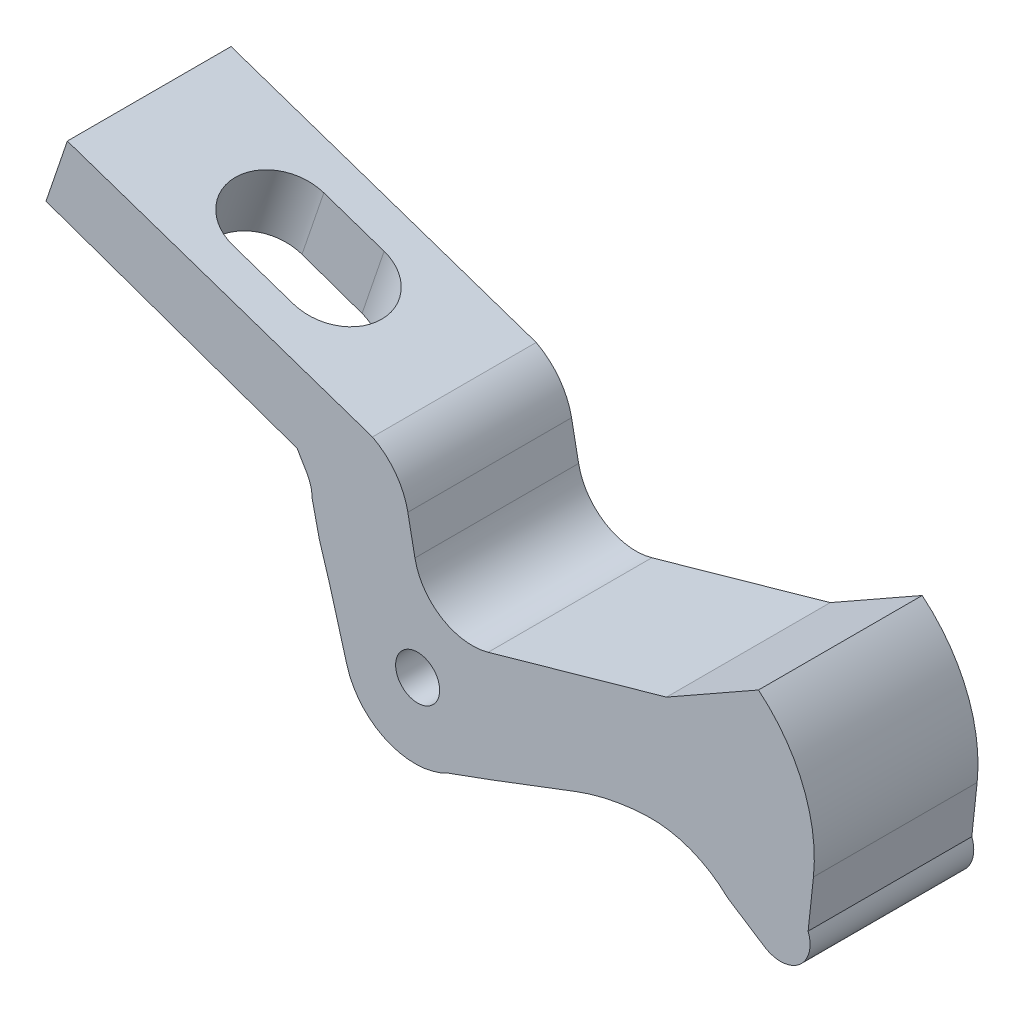
ISO-10303-21;
HEADER;
FILE_DESCRIPTION(('STEP AP214'),'2;1');
FILE_NAME('part.step','',(''),(''),'','','');
FILE_SCHEMA(('AUTOMOTIVE_DESIGN { 1 0 10303 214 1 1 1 1 }'));
ENDSEC;
DATA;
#1=APPLICATION_CONTEXT('core data for automotive mechanical design processes');
#2=APPLICATION_PROTOCOL_DEFINITION('international standard','automotive_design',2000,#1);
#3=PRODUCT_CONTEXT('',#1,'mechanical');
#4=PRODUCT('Part','Part','',(#3));
#5=PRODUCT_RELATED_PRODUCT_CATEGORY('part','',(#4));
#6=PRODUCT_DEFINITION_FORMATION('','',#4);
#7=PRODUCT_DEFINITION_CONTEXT('part definition',#1,'design');
#8=PRODUCT_DEFINITION('design','',#6,#7);
#9=PRODUCT_DEFINITION_SHAPE('','',#8);
#10=(LENGTH_UNIT() NAMED_UNIT(*) SI_UNIT(.MILLI.,.METRE.));
#11=(NAMED_UNIT(*) PLANE_ANGLE_UNIT() SI_UNIT($,.RADIAN.));
#12=(NAMED_UNIT(*) SI_UNIT($,.STERADIAN.) SOLID_ANGLE_UNIT());
#13=UNCERTAINTY_MEASURE_WITH_UNIT(LENGTH_MEASURE(1.E-05),#10,'distance_accuracy_value','');
#14=(GEOMETRIC_REPRESENTATION_CONTEXT(3) GLOBAL_UNCERTAINTY_ASSIGNED_CONTEXT((#13)) GLOBAL_UNIT_ASSIGNED_CONTEXT((#10,
#11,#12)) REPRESENTATION_CONTEXT('',''));
#15=CARTESIAN_POINT('',(0.,0.,0.));
#16=DIRECTION('',(0.,0.,1.));
#17=DIRECTION('',(1.,0.,0.));
#18=AXIS2_PLACEMENT_3D('',#15,#16,#17);
#19=CARTESIAN_POINT('',(45.5253919448835,21.3094985724797,18.));
#20=DIRECTION('',(0.,0.,1.));
#21=DIRECTION('',(1.,0.,0.));
#22=AXIS2_PLACEMENT_3D('',#19,#20,#21);
#23=PLANE('',#22);
#24=DIRECTION('',(0.219332222794712,-0.975650232431649,0.));
#25=VECTOR('',#24,1.);
#26=CARTESIAN_POINT('',(34.2322664001663,33.1216852431344,18.));
#27=LINE('',#26,#25);
#28=CARTESIAN_POINT('',(34.2322664001663,33.1216852431344,18.));
#29=VERTEX_POINT('',#28);
#30=CARTESIAN_POINT('',(35.0165157222853,29.6331279137085,18.));
#31=VERTEX_POINT('',#30);
#32=EDGE_CURVE('E327',#29,#31,#27,.T.);
#33=ORIENTED_EDGE('',*,*,#32,.T.);
#34=DIRECTION('',(0.294085848837523,-0.95577900872195,0.));
#35=VECTOR('',#34,1.);
#36=CARTESIAN_POINT('',(35.0165157222853,29.6331279137085,18.));
#37=LINE('',#36,#35);
#38=CARTESIAN_POINT('',(36.098238925208,26.1175275042095,18.));
#39=VERTEX_POINT('',#38);
#40=EDGE_CURVE('E330',#31,#39,#37,.T.);
#41=ORIENTED_EDGE('',*,*,#40,.T.);
#42=DIRECTION('',(0.271620892976652,-0.962404327971651,0.));
#43=VECTOR('',#42,1.);
#44=CARTESIAN_POINT('',(36.098238925208,26.1175275042095,18.));
#45=LINE('',#44,#43);
#46=CARTESIAN_POINT('',(38.0506171937993,19.1998810929243,18.));
#47=VERTEX_POINT('',#46);
#48=EDGE_CURVE('E333',#39,#47,#45,.T.);
#49=ORIENTED_EDGE('',*,*,#48,.T.);
#50=CARTESIAN_POINT('',(45.5253919448835,21.3094985724797,18.));
#51=DIRECTION('',(0.,0.,1.));
#52=DIRECTION('',(1.,0.,0.));
#53=AXIS2_PLACEMENT_3D('',#50,#51,#52);
#54=CIRCLE('',#53,7.76677175469267);
#55=CARTESIAN_POINT('',(49.1996547815683,14.4667990981167,18.));
#56=VERTEX_POINT('',#55);
#57=EDGE_CURVE('E335',#47,#56,#54,.T.);
#58=ORIENTED_EDGE('',*,*,#57,.T.);
#59=DIRECTION('',(0.939316602290552,0.34305148398066,0.));
#60=VECTOR('',#59,1.);
#61=CARTESIAN_POINT('',(49.1996547815683,14.4667990981167,18.));
#62=LINE('',#61,#60);
#63=CARTESIAN_POINT('',(53.8800761085958,16.1761540461461,18.));
#64=VERTEX_POINT('',#63);
#65=EDGE_CURVE('E337',#56,#64,#62,.T.);
#66=ORIENTED_EDGE('',*,*,#65,.T.);
#67=DIRECTION('',(0.934755486982712,0.35529168236213,0.));
#68=VECTOR('',#67,1.);
#69=CARTESIAN_POINT('',(53.8800761085958,16.1761540461461,18.));
#70=LINE('',#69,#68);
#71=CARTESIAN_POINT('',(63.1672079885199,19.7061046651984,18.));
#72=VERTEX_POINT('',#71);
#73=EDGE_CURVE('E339',#64,#72,#70,.T.);
#74=ORIENTED_EDGE('',*,*,#73,.T.);
#75=CARTESIAN_POINT('',(72.0012758517927,-3.53590694810821,18.));
#76=DIRECTION('',(0.,0.,-1.));
#77=DIRECTION('',(-1.,0.,0.));
#78=AXIS2_PLACEMENT_3D('',#75,#76,#77);
#79=CIRCLE('',#78,24.8642687172977);
#80=CARTESIAN_POINT('',(71.0329353313522,21.3094985724797,18.));
#81=VERTEX_POINT('',#80);
#82=EDGE_CURVE('E341',#72,#81,#79,.T.);
#83=ORIENTED_EDGE('',*,*,#82,.T.);
#84=CARTESIAN_POINT('',(71.506979557392,9.14660671570463,18.));
#85=DIRECTION('',(0.,0.,-1.));
#86=DIRECTION('',(-1.,0.,0.));
#87=AXIS2_PLACEMENT_3D('',#84,#85,#86);
#88=CIRCLE('',#87,12.1721262007855);
#89=CARTESIAN_POINT('',(79.9222649229007,17.9411293556722,18.));
#90=VERTEX_POINT('',#89);
#91=EDGE_CURVE('E343',#81,#90,#88,.T.);
#92=ORIENTED_EDGE('',*,*,#91,.T.);
#93=DIRECTION('',(0.839379612484412,-0.543545643111523,0.));
#94=VECTOR('',#93,1.);
#95=CARTESIAN_POINT('',(79.9222649229007,17.9411293556723,18.));
#96=LINE('',#95,#94);
#97=CARTESIAN_POINT('',(83.9677083298329,15.3214765721314,18.));
#98=VERTEX_POINT('',#97);
#99=EDGE_CURVE('E345',#90,#98,#96,.T.);
#100=ORIENTED_EDGE('',*,*,#99,.T.);
#101=CARTESIAN_POINT('',(85.7298879733201,18.0427524852468,18.));
#102=DIRECTION('',(0.,0.,1.));
#103=DIRECTION('',(1.,0.,0.));
#104=AXIS2_PLACEMENT_3D('',#101,#102,#103);
#105=CIRCLE('',#104,3.2420085890113);
#106=CARTESIAN_POINT('',(88.7583649959369,19.1998810929243,18.));
#107=VERTEX_POINT('',#106);
#108=EDGE_CURVE('E347',#98,#107,#105,.T.);
#109=ORIENTED_EDGE('',*,*,#108,.T.);
#110=DIRECTION('',(0.106791532196492,0.994281433323144,0.));
#111=VECTOR('',#110,1.);
#112=CARTESIAN_POINT('',(88.7583649959369,19.1998810929243,18.));
#113=LINE('',#112,#111);
#114=CARTESIAN_POINT('',(89.3438896995718,24.651402665862,18.));
#115=VERTEX_POINT('',#114);
#116=EDGE_CURVE('E349',#107,#115,#113,.T.);
#117=ORIENTED_EDGE('',*,*,#116,.T.);
#118=CARTESIAN_POINT('',(72.6215158410173,26.44748158926,18.));
#119=DIRECTION('',(0.,0.,1.));
#120=DIRECTION('',(1.,0.,0.));
#121=AXIS2_PLACEMENT_3D('',#118,#119,#120);
#122=CIRCLE('',#121,16.8185518688245);
#123=CARTESIAN_POINT('',(83.3015644321972,39.4397965890734,18.));
#124=VERTEX_POINT('',#123);
#125=EDGE_CURVE('E351',#115,#124,#122,.T.);
#126=ORIENTED_EDGE('',*,*,#125,.T.);
#127=DIRECTION('',(-0.869852027315479,-0.493312731008587,0.));
#128=VECTOR('',#127,1.);
#129=CARTESIAN_POINT('',(83.3015644321972,39.4397965890734,18.));
#130=LINE('',#129,#128);
#131=CARTESIAN_POINT('',(73.1896493904358,33.7051011830364,18.));
#132=VERTEX_POINT('',#131);
#133=EDGE_CURVE('E353',#124,#132,#130,.T.);
#134=ORIENTED_EDGE('',*,*,#133,.T.);
#135=DIRECTION('',(-0.962404327971652,-0.271620892976652,0.));
#136=VECTOR('',#135,1.);
#137=CARTESIAN_POINT('',(73.1896493904358,33.7051011830364,18.));
#138=LINE('',#137,#136);
#139=CARTESIAN_POINT('',(53.578886424286,28.1703245886236,18.));
#140=VERTEX_POINT('',#139);
#141=EDGE_CURVE('E355',#132,#140,#138,.T.);
#142=ORIENTED_EDGE('',*,*,#141,.T.);
#143=CARTESIAN_POINT('',(51.8330884395511,34.3560178829073,18.));
#144=DIRECTION('',(0.,0.,-1.));
#145=DIRECTION('',(-1.,0.,0.));
#146=AXIS2_PLACEMENT_3D('',#143,#144,#145);
#147=CIRCLE('',#146,6.42733320549438);
#148=CARTESIAN_POINT('',(45.5253919448835,33.1216852431344,18.));
#149=VERTEX_POINT('',#148);
#150=EDGE_CURVE('E357',#140,#149,#147,.T.);
#151=ORIENTED_EDGE('',*,*,#150,.T.);
#152=DIRECTION('',(-0.19204428964687,0.981386259743853,0.));
#153=VECTOR('',#152,1.);
#154=CARTESIAN_POINT('',(45.5253919448835,33.1216852431344,18.));
#155=LINE('',#154,#153);
#156=CARTESIAN_POINT('',(44.7492996050408,37.0876785044525,18.));
#157=VERTEX_POINT('',#156);
#158=EDGE_CURVE('E359',#149,#157,#155,.T.);
#159=ORIENTED_EDGE('',*,*,#158,.T.);
#160=CARTESIAN_POINT('',(37.3562633686608,35.6409592557851,18.));
#161=DIRECTION('',(0.,0.,1.));
#162=DIRECTION('',(1.,0.,0.));
#163=AXIS2_PLACEMENT_3D('',#160,#161,#162);
#164=CIRCLE('',#163,7.5332583506005);
#165=CARTESIAN_POINT('',(40.8576012745902,42.3110877586997,18.));
#166=VERTEX_POINT('',#165);
#167=EDGE_CURVE('E361',#157,#166,#164,.T.);
#168=ORIENTED_EDGE('',*,*,#167,.T.);
#169=DIRECTION('',(0.94679952157974,-0.321823967311907,0.));
#170=VECTOR('',#169,1.);
#171=CARTESIAN_POINT('',(7.30944569515984,53.7143471377868,18.));
#172=LINE('',#171,#170);
#173=CARTESIAN_POINT('',(7.30944569515984,53.7143471377868,18.));
#174=VERTEX_POINT('',#173);
#175=EDGE_CURVE('E363',#174,#166,#172,.T.);
#176=ORIENTED_EDGE('',*,*,#175,.F.);
#177=DIRECTION('',(-0.321823967311907,-0.94679952157974,0.));
#178=VECTOR('',#177,1.);
#179=CARTESIAN_POINT('',(7.30944569515984,53.7143471377868,18.));
#180=LINE('',#179,#178);
#181=CARTESIAN_POINT('',(4.96334493977308,46.8121667584579,18.));
#182=VERTEX_POINT('',#181);
#183=EDGE_CURVE('E366',#174,#182,#180,.T.);
#184=ORIENTED_EDGE('',*,*,#183,.T.);
#185=DIRECTION('',(0.943199177295915,-0.332227801287473,0.));
#186=VECTOR('',#185,1.);
#187=CARTESIAN_POINT('',(4.96334493977308,46.8121667584579,18.));
#188=LINE('',#187,#186);
#189=CARTESIAN_POINT('',(32.5712973304433,37.0876785044525,18.));
#190=VERTEX_POINT('',#189);
#191=EDGE_CURVE('E368',#182,#190,#188,.T.);
#192=ORIENTED_EDGE('',*,*,#191,.T.);
#193=DIRECTION('',(0.510840332146581,-0.859675610362636,0.));
#194=VECTOR('',#193,1.);
#195=CARTESIAN_POINT('',(32.5712973304433,37.0876785044525,18.));
#196=LINE('',#195,#194);
#197=CARTESIAN_POINT('',(33.6102755584857,35.339217809126,18.));
#198=VERTEX_POINT('',#197);
#199=EDGE_CURVE('E370',#190,#198,#196,.T.);
#200=ORIENTED_EDGE('',*,*,#199,.T.);
#201=CARTESIAN_POINT('',(29.7981725271643,33.0739726919873,18.));
#202=DIRECTION('',(0.,0.,-1.));
#203=DIRECTION('',(-1.,0.,0.));
#204=AXIS2_PLACEMENT_3D('',#201,#202,#203);
#205=CIRCLE('',#204,4.43435056824905);
#206=EDGE_CURVE('E372',#198,#29,#205,.T.);
#207=ORIENTED_EDGE('',*,*,#206,.T.);
#208=EDGE_LOOP('',(#33,#41,#49,#58,#66,#74,#83,#92,#100,#109,#117,#126,#134,#142,#151,#159,#168,
#176,#184,#192,#200,#207));
#209=FACE_BOUND('',#208,.T.);
#210=CARTESIAN_POINT('',(45.8228161935071,21.8786184753552,18.));
#211=DIRECTION('',(0.,0.,1.));
#212=DIRECTION('',(1.,0.,0.));
#213=AXIS2_PLACEMENT_3D('',#210,#211,#212);
#214=CIRCLE('',#213,2.42054008083515);
#215=CARTESIAN_POINT('',(48.2433562743423,21.8786184753552,18.));
#216=VERTEX_POINT('',#215);
#217=EDGE_CURVE('E321',#216,#216,#214,.T.);
#218=ORIENTED_EDGE('',*,*,#217,.F.);
#219=EDGE_LOOP('',(#218));
#220=FACE_BOUND('',#219,.T.);
#221=ADVANCED_FACE('F119',(#209,#220),#23,.T.);
#222=CARTESIAN_POINT('',(45.5253919448835,21.3094985724797,0.));
#223=DIRECTION('',(0.,0.,1.));
#224=DIRECTION('',(1.,0.,0.));
#225=AXIS2_PLACEMENT_3D('',#222,#223,#224);
#226=PLANE('',#225);
#227=DIRECTION('',(0.219332222794712,-0.975650232431649,0.));
#228=VECTOR('',#227,1.);
#229=CARTESIAN_POINT('',(34.2322664001663,33.1216852431344,0.));
#230=LINE('',#229,#228);
#231=CARTESIAN_POINT('',(34.2322664001663,33.1216852431344,0.));
#232=VERTEX_POINT('',#231);
#233=CARTESIAN_POINT('',(35.0165157222853,29.6331279137085,0.));
#234=VERTEX_POINT('',#233);
#235=EDGE_CURVE('E324',#232,#234,#230,.T.);
#236=ORIENTED_EDGE('',*,*,#235,.F.);
#237=CARTESIAN_POINT('',(29.7981725271643,33.0739726919873,0.));
#238=DIRECTION('',(0.,0.,-1.));
#239=DIRECTION('',(-1.,0.,0.));
#240=AXIS2_PLACEMENT_3D('',#237,#238,#239);
#241=CIRCLE('',#240,4.43435056824905);
#242=CARTESIAN_POINT('',(33.6102755584857,35.339217809126,0.));
#243=VERTEX_POINT('',#242);
#244=EDGE_CURVE('E331',#243,#232,#241,.T.);
#245=ORIENTED_EDGE('',*,*,#244,.F.);
#246=DIRECTION('',(0.510840332146581,-0.859675610362636,0.));
#247=VECTOR('',#246,1.);
#248=CARTESIAN_POINT('',(32.5712973304433,37.0876785044525,0.));
#249=LINE('',#248,#247);
#250=CARTESIAN_POINT('',(32.5712973304433,37.0876785044525,0.));
#251=VERTEX_POINT('',#250);
#252=EDGE_CURVE('E419',#251,#243,#249,.T.);
#253=ORIENTED_EDGE('',*,*,#252,.F.);
#254=DIRECTION('',(0.943199177295915,-0.332227801287473,0.));
#255=VECTOR('',#254,1.);
#256=CARTESIAN_POINT('',(4.96334493977308,46.8121667584579,0.));
#257=LINE('',#256,#255);
#258=CARTESIAN_POINT('',(4.96334493977308,46.8121667584579,0.));
#259=VERTEX_POINT('',#258);
#260=EDGE_CURVE('E417',#259,#251,#257,.T.);
#261=ORIENTED_EDGE('',*,*,#260,.F.);
#262=DIRECTION('',(-0.321823967311907,-0.94679952157974,0.));
#263=VECTOR('',#262,1.);
#264=CARTESIAN_POINT('',(7.30944569515984,53.7143471377868,0.));
#265=LINE('',#264,#263);
#266=CARTESIAN_POINT('',(7.30944569515984,53.7143471377868,0.));
#267=VERTEX_POINT('',#266);
#268=EDGE_CURVE('E415',#267,#259,#265,.T.);
#269=ORIENTED_EDGE('',*,*,#268,.F.);
#270=DIRECTION('',(0.94679952157974,-0.321823967311907,0.));
#271=VECTOR('',#270,1.);
#272=CARTESIAN_POINT('',(7.30944569515984,53.7143471377868,0.));
#273=LINE('',#272,#271);
#274=CARTESIAN_POINT('',(40.8576012745902,42.3110877586997,0.));
#275=VERTEX_POINT('',#274);
#276=EDGE_CURVE('E412',#267,#275,#273,.T.);
#277=ORIENTED_EDGE('',*,*,#276,.T.);
#278=CARTESIAN_POINT('',(37.3562633686608,35.6409592557851,0.));
#279=DIRECTION('',(0.,0.,1.));
#280=DIRECTION('',(1.,0.,0.));
#281=AXIS2_PLACEMENT_3D('',#278,#279,#280);
#282=CIRCLE('',#281,7.5332583506005);
#283=CARTESIAN_POINT('',(44.7492996050408,37.0876785044525,0.));
#284=VERTEX_POINT('',#283);
#285=EDGE_CURVE('E409',#284,#275,#282,.T.);
#286=ORIENTED_EDGE('',*,*,#285,.F.);
#287=DIRECTION('',(-0.19204428964687,0.981386259743853,0.));
#288=VECTOR('',#287,1.);
#289=CARTESIAN_POINT('',(45.5253919448835,33.1216852431344,0.));
#290=LINE('',#289,#288);
#291=CARTESIAN_POINT('',(45.5253919448835,33.1216852431344,0.));
#292=VERTEX_POINT('',#291);
#293=EDGE_CURVE('E407',#292,#284,#290,.T.);
#294=ORIENTED_EDGE('',*,*,#293,.F.);
#295=CARTESIAN_POINT('',(51.8330884395511,34.3560178829073,0.));
#296=DIRECTION('',(0.,0.,-1.));
#297=DIRECTION('',(-1.,0.,0.));
#298=AXIS2_PLACEMENT_3D('',#295,#296,#297);
#299=CIRCLE('',#298,6.42733320549438);
#300=CARTESIAN_POINT('',(53.578886424286,28.1703245886236,0.));
#301=VERTEX_POINT('',#300);
#302=EDGE_CURVE('E405',#301,#292,#299,.T.);
#303=ORIENTED_EDGE('',*,*,#302,.F.);
#304=DIRECTION('',(-0.962404327971652,-0.271620892976652,0.));
#305=VECTOR('',#304,1.);
#306=CARTESIAN_POINT('',(60.3348577971169,30.0770730558511,0.));
#307=LINE('',#306,#305);
#308=CARTESIAN_POINT('',(73.1896493904358,33.7051011830364,0.));
#309=VERTEX_POINT('',#308);
#310=EDGE_CURVE('E403',#309,#301,#307,.T.);
#311=ORIENTED_EDGE('',*,*,#310,.F.);
#312=DIRECTION('',(-0.86985202731548,-0.493312731008587,0.));
#313=VECTOR('',#312,1.);
#314=CARTESIAN_POINT('',(77.6866251453855,36.255437701536,0.));
#315=LINE('',#314,#313);
#316=CARTESIAN_POINT('',(83.3015644321972,39.4397965890734,0.));
#317=VERTEX_POINT('',#316);
#318=EDGE_CURVE('E400',#317,#309,#315,.T.);
#319=ORIENTED_EDGE('',*,*,#318,.F.);
#320=CARTESIAN_POINT('',(72.6215158410173,26.44748158926,0.));
#321=DIRECTION('',(0.,0.,1.));
#322=DIRECTION('',(1.,0.,0.));
#323=AXIS2_PLACEMENT_3D('',#320,#321,#322);
#324=CIRCLE('',#323,16.8185518688245);
#325=CARTESIAN_POINT('',(89.3438896995718,24.651402665862,0.));
#326=VERTEX_POINT('',#325);
#327=EDGE_CURVE('E397',#326,#317,#324,.T.);
#328=ORIENTED_EDGE('',*,*,#327,.F.);
#329=DIRECTION('',(0.106791532196492,0.994281433323144,0.));
#330=VECTOR('',#329,1.);
#331=CARTESIAN_POINT('',(88.7583649959369,19.1998810929243,0.));
#332=LINE('',#331,#330);
#333=CARTESIAN_POINT('',(88.7583649959369,19.1998810929243,0.));
#334=VERTEX_POINT('',#333);
#335=EDGE_CURVE('E395',#334,#326,#332,.T.);
#336=ORIENTED_EDGE('',*,*,#335,.F.);
#337=CARTESIAN_POINT('',(85.7298879733201,18.0427524852468,0.));
#338=DIRECTION('',(0.,0.,1.));
#339=DIRECTION('',(1.,0.,0.));
#340=AXIS2_PLACEMENT_3D('',#337,#338,#339);
#341=CIRCLE('',#340,3.2420085890113);
#342=CARTESIAN_POINT('',(83.9677083298329,15.3214765721314,0.));
#343=VERTEX_POINT('',#342);
#344=EDGE_CURVE('E393',#343,#334,#341,.T.);
#345=ORIENTED_EDGE('',*,*,#344,.F.);
#346=DIRECTION('',(0.839379612484412,-0.543545643111523,0.));
#347=VECTOR('',#346,1.);
#348=CARTESIAN_POINT('',(79.9222649229007,17.9411293556723,0.));
#349=LINE('',#348,#347);
#350=CARTESIAN_POINT('',(79.9222649229007,17.9411293556722,0.));
#351=VERTEX_POINT('',#350);
#352=EDGE_CURVE('E391',#351,#343,#349,.T.);
#353=ORIENTED_EDGE('',*,*,#352,.F.);
#354=CARTESIAN_POINT('',(71.506979557392,9.14660671570463,0.));
#355=DIRECTION('',(0.,0.,-1.));
#356=DIRECTION('',(-1.,0.,0.));
#357=AXIS2_PLACEMENT_3D('',#354,#355,#356);
#358=CIRCLE('',#357,12.1721262007855);
#359=CARTESIAN_POINT('',(71.0329353313522,21.3094985724797,0.));
#360=VERTEX_POINT('',#359);
#361=EDGE_CURVE('E389',#360,#351,#358,.T.);
#362=ORIENTED_EDGE('',*,*,#361,.F.);
#363=CARTESIAN_POINT('',(72.0012758517927,-3.53590694810821,0.));
#364=DIRECTION('',(0.,0.,-1.));
#365=DIRECTION('',(-1.,0.,0.));
#366=AXIS2_PLACEMENT_3D('',#363,#364,#365);
#367=CIRCLE('',#366,24.8642687172977);
#368=CARTESIAN_POINT('',(63.1672079885199,19.7061046651984,0.));
#369=VERTEX_POINT('',#368);
#370=EDGE_CURVE('E387',#369,#360,#367,.T.);
#371=ORIENTED_EDGE('',*,*,#370,.F.);
#372=DIRECTION('',(0.934755486982712,0.35529168236213,0.));
#373=VECTOR('',#372,1.);
#374=CARTESIAN_POINT('',(53.8800761085958,16.1761540461461,0.));
#375=LINE('',#374,#373);
#376=CARTESIAN_POINT('',(53.8800761085958,16.1761540461461,0.));
#377=VERTEX_POINT('',#376);
#378=EDGE_CURVE('E385',#377,#369,#375,.T.);
#379=ORIENTED_EDGE('',*,*,#378,.F.);
#380=DIRECTION('',(0.939316602290552,0.34305148398066,0.));
#381=VECTOR('',#380,1.);
#382=CARTESIAN_POINT('',(49.1996547815683,14.4667990981167,0.));
#383=LINE('',#382,#381);
#384=CARTESIAN_POINT('',(49.1996547815683,14.4667990981167,0.));
#385=VERTEX_POINT('',#384);
#386=EDGE_CURVE('E383',#385,#377,#383,.T.);
#387=ORIENTED_EDGE('',*,*,#386,.F.);
#388=CARTESIAN_POINT('',(45.5253919448835,21.3094985724797,0.));
#389=DIRECTION('',(0.,0.,1.));
#390=DIRECTION('',(1.,0.,0.));
#391=AXIS2_PLACEMENT_3D('',#388,#389,#390);
#392=CIRCLE('',#391,7.76677175469267);
#393=CARTESIAN_POINT('',(38.0506171937993,19.1998810929243,0.));
#394=VERTEX_POINT('',#393);
#395=EDGE_CURVE('E381',#394,#385,#392,.T.);
#396=ORIENTED_EDGE('',*,*,#395,.F.);
#397=DIRECTION('',(0.271620892976652,-0.962404327971651,0.));
#398=VECTOR('',#397,1.);
#399=CARTESIAN_POINT('',(36.098238925208,26.1175275042095,0.));
#400=LINE('',#399,#398);
#401=CARTESIAN_POINT('',(36.098238925208,26.1175275042095,0.));
#402=VERTEX_POINT('',#401);
#403=EDGE_CURVE('E379',#402,#394,#400,.T.);
#404=ORIENTED_EDGE('',*,*,#403,.F.);
#405=DIRECTION('',(0.294085848837523,-0.95577900872195,0.));
#406=VECTOR('',#405,1.);
#407=CARTESIAN_POINT('',(35.0165157222853,29.6331279137085,0.));
#408=LINE('',#407,#406);
#409=EDGE_CURVE('E377',#234,#402,#408,.T.);
#410=ORIENTED_EDGE('',*,*,#409,.F.);
#411=EDGE_LOOP('',(#236,#245,#253,#261,#269,#277,#286,#294,#303,#311,#319,#328,#336,#345,#353,
#362,#371,#379,#387,#396,#404,#410));
#412=FACE_BOUND('',#411,.T.);
#413=CARTESIAN_POINT('',(45.8228161935071,21.8786184753552,0.));
#414=DIRECTION('',(0.,0.,1.));
#415=DIRECTION('',(1.,0.,0.));
#416=AXIS2_PLACEMENT_3D('',#413,#414,#415);
#417=CIRCLE('',#416,2.42054008083515);
#418=CARTESIAN_POINT('',(48.2433562743423,21.8786184753552,0.));
#419=VERTEX_POINT('',#418);
#420=EDGE_CURVE('E318',#419,#419,#417,.T.);
#421=ORIENTED_EDGE('',*,*,#420,.T.);
#422=EDGE_LOOP('',(#421));
#423=FACE_BOUND('',#422,.T.);
#424=ADVANCED_FACE('F508',(#412,#423),#226,.F.);
#425=CARTESIAN_POINT('',(34.2322664001663,33.1216852431344,18.));
#426=DIRECTION('',(0.975650232431649,0.219332222794712,0.));
#427=DIRECTION('',(-0.219332222794712,0.975650232431649,0.));
#428=AXIS2_PLACEMENT_3D('',#425,#426,#427);
#429=PLANE('',#428);
#430=ORIENTED_EDGE('',*,*,#235,.T.);
#431=DIRECTION('',(0.,0.,-1.));
#432=VECTOR('',#431,1.);
#433=CARTESIAN_POINT('',(35.0165157222853,29.6331279137085,18.));
#434=LINE('',#433,#432);
#435=EDGE_CURVE('E482',#31,#234,#434,.T.);
#436=ORIENTED_EDGE('',*,*,#435,.F.);
#437=ORIENTED_EDGE('',*,*,#32,.F.);
#438=DIRECTION('',(0.,0.,-1.));
#439=VECTOR('',#438,1.);
#440=CARTESIAN_POINT('',(34.2322664001663,33.1216852431344,18.));
#441=LINE('',#440,#439);
#442=EDGE_CURVE('E374',#29,#232,#441,.T.);
#443=ORIENTED_EDGE('',*,*,#442,.T.);
#444=EDGE_LOOP('',(#430,#436,#437,#443));
#445=FACE_BOUND('',#444,.T.);
#446=ADVANCED_FACE('F121',(#445),#429,.F.);
#447=CARTESIAN_POINT('',(35.0165157222853,29.6331279137085,18.));
#448=DIRECTION('',(0.95577900872195,0.294085848837523,0.));
#449=DIRECTION('',(-0.294085848837523,0.95577900872195,0.));
#450=AXIS2_PLACEMENT_3D('',#447,#448,#449);
#451=PLANE('',#450);
#452=ORIENTED_EDGE('',*,*,#409,.T.);
#453=DIRECTION('',(0.,0.,-1.));
#454=VECTOR('',#453,1.);
#455=CARTESIAN_POINT('',(36.098238925208,26.1175275042095,18.));
#456=LINE('',#455,#454);
#457=EDGE_CURVE('E479',#39,#402,#456,.T.);
#458=ORIENTED_EDGE('',*,*,#457,.F.);
#459=ORIENTED_EDGE('',*,*,#40,.F.);
#460=ORIENTED_EDGE('',*,*,#435,.T.);
#461=EDGE_LOOP('',(#452,#458,#459,#460));
#462=FACE_BOUND('',#461,.T.);
#463=ADVANCED_FACE('F591',(#462),#451,.F.);
#464=CARTESIAN_POINT('',(36.098238925208,26.1175275042095,18.));
#465=DIRECTION('',(0.962404327971651,0.271620892976652,0.));
#466=DIRECTION('',(-0.271620892976652,0.962404327971652,0.));
#467=AXIS2_PLACEMENT_3D('',#464,#465,#466);
#468=PLANE('',#467);
#469=ORIENTED_EDGE('',*,*,#403,.T.);
#470=DIRECTION('',(0.,0.,-1.));
#471=VECTOR('',#470,1.);
#472=CARTESIAN_POINT('',(38.0506171937993,19.1998810929243,18.));
#473=LINE('',#472,#471);
#474=EDGE_CURVE('E476',#47,#394,#473,.T.);
#475=ORIENTED_EDGE('',*,*,#474,.F.);
#476=ORIENTED_EDGE('',*,*,#48,.F.);
#477=ORIENTED_EDGE('',*,*,#457,.T.);
#478=EDGE_LOOP('',(#469,#475,#476,#477));
#479=FACE_BOUND('',#478,.T.);
#480=ADVANCED_FACE('F588',(#479),#468,.F.);
#481=CARTESIAN_POINT('',(45.5253919448835,21.3094985724797,18.));
#482=DIRECTION('',(0.,0.,-1.));
#483=DIRECTION('',(-1.,0.,0.));
#484=AXIS2_PLACEMENT_3D('',#481,#482,#483);
#485=CYLINDRICAL_SURFACE('',#484,7.76677175469267);
#486=ORIENTED_EDGE('',*,*,#395,.T.);
#487=DIRECTION('',(0.,0.,-1.));
#488=VECTOR('',#487,1.);
#489=CARTESIAN_POINT('',(49.1996547815683,14.4667990981167,18.));
#490=LINE('',#489,#488);
#491=EDGE_CURVE('E473',#56,#385,#490,.T.);
#492=ORIENTED_EDGE('',*,*,#491,.F.);
#493=ORIENTED_EDGE('',*,*,#57,.F.);
#494=ORIENTED_EDGE('',*,*,#474,.T.);
#495=EDGE_LOOP('',(#486,#492,#493,#494));
#496=FACE_BOUND('',#495,.T.);
#497=ADVANCED_FACE('F584',(#496),#485,.T.);
#498=CARTESIAN_POINT('',(49.1996547815683,14.4667990981167,18.));
#499=DIRECTION('',(-0.343051483980661,0.939316602290552,0.));
#500=DIRECTION('',(-0.939316602290552,-0.343051483980661,0.));
#501=AXIS2_PLACEMENT_3D('',#498,#499,#500);
#502=PLANE('',#501);
#503=ORIENTED_EDGE('',*,*,#386,.T.);
#504=DIRECTION('',(0.,0.,-1.));
#505=VECTOR('',#504,1.);
#506=CARTESIAN_POINT('',(53.8800761085958,16.1761540461461,18.));
#507=LINE('',#506,#505);
#508=EDGE_CURVE('E470',#64,#377,#507,.T.);
#509=ORIENTED_EDGE('',*,*,#508,.F.);
#510=ORIENTED_EDGE('',*,*,#65,.F.);
#511=ORIENTED_EDGE('',*,*,#491,.T.);
#512=EDGE_LOOP('',(#503,#509,#510,#511));
#513=FACE_BOUND('',#512,.T.);
#514=ADVANCED_FACE('F580',(#513),#502,.F.);
#515=CARTESIAN_POINT('',(53.8800761085958,16.1761540461461,18.));
#516=DIRECTION('',(-0.35529168236213,0.934755486982712,0.));
#517=DIRECTION('',(-0.934755486982712,-0.35529168236213,0.));
#518=AXIS2_PLACEMENT_3D('',#515,#516,#517);
#519=PLANE('',#518);
#520=ORIENTED_EDGE('',*,*,#378,.T.);
#521=DIRECTION('',(0.,0.,-1.));
#522=VECTOR('',#521,1.);
#523=CARTESIAN_POINT('',(63.1672079885199,19.7061046651984,18.));
#524=LINE('',#523,#522);
#525=EDGE_CURVE('E467',#72,#369,#524,.T.);
#526=ORIENTED_EDGE('',*,*,#525,.F.);
#527=ORIENTED_EDGE('',*,*,#73,.F.);
#528=ORIENTED_EDGE('',*,*,#508,.T.);
#529=EDGE_LOOP('',(#520,#526,#527,#528));
#530=FACE_BOUND('',#529,.T.);
#531=ADVANCED_FACE('F576',(#530),#519,.F.);
#532=CARTESIAN_POINT('',(72.0012758517927,-3.53590694810821,18.));
#533=DIRECTION('',(0.,0.,-1.));
#534=DIRECTION('',(-1.,0.,0.));
#535=AXIS2_PLACEMENT_3D('',#532,#533,#534);
#536=CYLINDRICAL_SURFACE('',#535,24.8642687172977);
#537=ORIENTED_EDGE('',*,*,#370,.T.);
#538=DIRECTION('',(0.,0.,-1.));
#539=VECTOR('',#538,1.);
#540=CARTESIAN_POINT('',(71.0329353313522,21.3094985724797,18.));
#541=LINE('',#540,#539);
#542=EDGE_CURVE('E464',#81,#360,#541,.T.);
#543=ORIENTED_EDGE('',*,*,#542,.F.);
#544=ORIENTED_EDGE('',*,*,#82,.F.);
#545=ORIENTED_EDGE('',*,*,#525,.T.);
#546=EDGE_LOOP('',(#537,#543,#544,#545));
#547=FACE_BOUND('',#546,.T.);
#548=ADVANCED_FACE('F572',(#547),#536,.F.);
#549=CARTESIAN_POINT('',(71.506979557392,9.14660671570463,18.));
#550=DIRECTION('',(0.,0.,-1.));
#551=DIRECTION('',(-1.,0.,0.));
#552=AXIS2_PLACEMENT_3D('',#549,#550,#551);
#553=CYLINDRICAL_SURFACE('',#552,12.1721262007855);
#554=ORIENTED_EDGE('',*,*,#361,.T.);
#555=DIRECTION('',(0.,0.,-1.));
#556=VECTOR('',#555,1.);
#557=CARTESIAN_POINT('',(79.9222649229007,17.9411293556722,18.));
#558=LINE('',#557,#556);
#559=EDGE_CURVE('E461',#90,#351,#558,.T.);
#560=ORIENTED_EDGE('',*,*,#559,.F.);
#561=ORIENTED_EDGE('',*,*,#91,.F.);
#562=ORIENTED_EDGE('',*,*,#542,.T.);
#563=EDGE_LOOP('',(#554,#560,#561,#562));
#564=FACE_BOUND('',#563,.T.);
#565=ADVANCED_FACE('F568',(#564),#553,.F.);
#566=CARTESIAN_POINT('',(79.9222649229007,17.9411293556723,18.));
#567=DIRECTION('',(0.543545643111523,0.839379612484412,0.));
#568=DIRECTION('',(-0.839379612484412,0.543545643111523,0.));
#569=AXIS2_PLACEMENT_3D('',#566,#567,#568);
#570=PLANE('',#569);
#571=ORIENTED_EDGE('',*,*,#352,.T.);
#572=DIRECTION('',(0.,0.,-1.));
#573=VECTOR('',#572,1.);
#574=CARTESIAN_POINT('',(83.9677083298329,15.3214765721314,18.));
#575=LINE('',#574,#573);
#576=EDGE_CURVE('E458',#98,#343,#575,.T.);
#577=ORIENTED_EDGE('',*,*,#576,.F.);
#578=ORIENTED_EDGE('',*,*,#99,.F.);
#579=ORIENTED_EDGE('',*,*,#559,.T.);
#580=EDGE_LOOP('',(#571,#577,#578,#579));
#581=FACE_BOUND('',#580,.T.);
#582=ADVANCED_FACE('F564',(#581),#570,.F.);
#583=CARTESIAN_POINT('',(85.7298879733201,18.0427524852468,18.));
#584=DIRECTION('',(0.,0.,-1.));
#585=DIRECTION('',(-1.,0.,0.));
#586=AXIS2_PLACEMENT_3D('',#583,#584,#585);
#587=CYLINDRICAL_SURFACE('',#586,3.2420085890113);
#588=ORIENTED_EDGE('',*,*,#344,.T.);
#589=DIRECTION('',(0.,0.,-1.));
#590=VECTOR('',#589,1.);
#591=CARTESIAN_POINT('',(88.7583649959369,19.1998810929243,18.));
#592=LINE('',#591,#590);
#593=EDGE_CURVE('E455',#107,#334,#592,.T.);
#594=ORIENTED_EDGE('',*,*,#593,.F.);
#595=ORIENTED_EDGE('',*,*,#108,.F.);
#596=ORIENTED_EDGE('',*,*,#576,.T.);
#597=EDGE_LOOP('',(#588,#594,#595,#596));
#598=FACE_BOUND('',#597,.T.);
#599=ADVANCED_FACE('F560',(#598),#587,.T.);
#600=CARTESIAN_POINT('',(88.7583649959369,19.1998810929243,18.));
#601=DIRECTION('',(-0.994281433323144,0.106791532196492,0.));
#602=DIRECTION('',(-0.106791532196492,-0.994281433323144,0.));
#603=AXIS2_PLACEMENT_3D('',#600,#601,#602);
#604=PLANE('',#603);
#605=ORIENTED_EDGE('',*,*,#335,.T.);
#606=DIRECTION('',(0.,0.,-1.));
#607=VECTOR('',#606,1.);
#608=CARTESIAN_POINT('',(89.3438896995718,24.651402665862,18.));
#609=LINE('',#608,#607);
#610=EDGE_CURVE('E452',#115,#326,#609,.T.);
#611=ORIENTED_EDGE('',*,*,#610,.F.);
#612=ORIENTED_EDGE('',*,*,#116,.F.);
#613=ORIENTED_EDGE('',*,*,#593,.T.);
#614=EDGE_LOOP('',(#605,#611,#612,#613));
#615=FACE_BOUND('',#614,.T.);
#616=ADVANCED_FACE('F556',(#615),#604,.F.);
#617=CARTESIAN_POINT('',(72.6215158410173,26.44748158926,18.));
#618=DIRECTION('',(0.,0.,-1.));
#619=DIRECTION('',(-1.,0.,0.));
#620=AXIS2_PLACEMENT_3D('',#617,#618,#619);
#621=CYLINDRICAL_SURFACE('',#620,16.8185518688245);
#622=ORIENTED_EDGE('',*,*,#327,.T.);
#623=DIRECTION('',(0.,0.,-1.));
#624=VECTOR('',#623,1.);
#625=CARTESIAN_POINT('',(83.3015644321972,39.4397965890734,18.));
#626=LINE('',#625,#624);
#627=EDGE_CURVE('E449',#124,#317,#626,.T.);
#628=ORIENTED_EDGE('',*,*,#627,.F.);
#629=ORIENTED_EDGE('',*,*,#125,.F.);
#630=ORIENTED_EDGE('',*,*,#610,.T.);
#631=EDGE_LOOP('',(#622,#628,#629,#630));
#632=FACE_BOUND('',#631,.T.);
#633=ADVANCED_FACE('F552',(#632),#621,.T.);
#634=CARTESIAN_POINT('',(77.6866251453855,36.255437701536,18.));
#635=DIRECTION('',(0.493312731008587,-0.86985202731548,0.));
#636=DIRECTION('',(0.86985202731548,0.493312731008587,0.));
#637=AXIS2_PLACEMENT_3D('',#634,#635,#636);
#638=PLANE('',#637);
#639=ORIENTED_EDGE('',*,*,#318,.T.);
#640=DIRECTION('',(0.,0.,-1.));
#641=VECTOR('',#640,1.);
#642=CARTESIAN_POINT('',(73.1896493904358,33.7051011830364,18.));
#643=LINE('',#642,#641);
#644=EDGE_CURVE('E446',#132,#309,#643,.T.);
#645=ORIENTED_EDGE('',*,*,#644,.F.);
#646=ORIENTED_EDGE('',*,*,#133,.F.);
#647=ORIENTED_EDGE('',*,*,#627,.T.);
#648=EDGE_LOOP('',(#639,#645,#646,#647));
#649=FACE_BOUND('',#648,.T.);
#650=ADVANCED_FACE('F548',(#649),#638,.F.);
#651=CARTESIAN_POINT('',(60.3348577971169,30.0770730558511,18.));
#652=DIRECTION('',(0.271620892976652,-0.962404327971652,0.));
#653=DIRECTION('',(0.962404327971652,0.271620892976652,0.));
#654=AXIS2_PLACEMENT_3D('',#651,#652,#653);
#655=PLANE('',#654);
#656=ORIENTED_EDGE('',*,*,#310,.T.);
#657=DIRECTION('',(0.,0.,-1.));
#658=VECTOR('',#657,1.);
#659=CARTESIAN_POINT('',(53.578886424286,28.1703245886236,18.));
#660=LINE('',#659,#658);
#661=EDGE_CURVE('E443',#140,#301,#660,.T.);
#662=ORIENTED_EDGE('',*,*,#661,.F.);
#663=ORIENTED_EDGE('',*,*,#141,.F.);
#664=ORIENTED_EDGE('',*,*,#644,.T.);
#665=EDGE_LOOP('',(#656,#662,#663,#664));
#666=FACE_BOUND('',#665,.T.);
#667=ADVANCED_FACE('F544',(#666),#655,.F.);
#668=CARTESIAN_POINT('',(51.8330884395511,34.3560178829073,18.));
#669=DIRECTION('',(0.,0.,-1.));
#670=DIRECTION('',(-1.,0.,0.));
#671=AXIS2_PLACEMENT_3D('',#668,#669,#670);
#672=CYLINDRICAL_SURFACE('',#671,6.42733320549438);
#673=ORIENTED_EDGE('',*,*,#302,.T.);
#674=DIRECTION('',(0.,0.,-1.));
#675=VECTOR('',#674,1.);
#676=CARTESIAN_POINT('',(45.5253919448835,33.1216852431344,18.));
#677=LINE('',#676,#675);
#678=EDGE_CURVE('E440',#149,#292,#677,.T.);
#679=ORIENTED_EDGE('',*,*,#678,.F.);
#680=ORIENTED_EDGE('',*,*,#150,.F.);
#681=ORIENTED_EDGE('',*,*,#661,.T.);
#682=EDGE_LOOP('',(#673,#679,#680,#681));
#683=FACE_BOUND('',#682,.T.);
#684=ADVANCED_FACE('F540',(#683),#672,.F.);
#685=CARTESIAN_POINT('',(45.5253919448835,33.1216852431344,18.));
#686=DIRECTION('',(-0.981386259743853,-0.19204428964687,0.));
#687=DIRECTION('',(0.19204428964687,-0.981386259743853,0.));
#688=AXIS2_PLACEMENT_3D('',#685,#686,#687);
#689=PLANE('',#688);
#690=ORIENTED_EDGE('',*,*,#293,.T.);
#691=DIRECTION('',(0.,0.,-1.));
#692=VECTOR('',#691,1.);
#693=CARTESIAN_POINT('',(44.7492996050408,37.0876785044525,18.));
#694=LINE('',#693,#692);
#695=EDGE_CURVE('E437',#157,#284,#694,.T.);
#696=ORIENTED_EDGE('',*,*,#695,.F.);
#697=ORIENTED_EDGE('',*,*,#158,.F.);
#698=ORIENTED_EDGE('',*,*,#678,.T.);
#699=EDGE_LOOP('',(#690,#696,#697,#698));
#700=FACE_BOUND('',#699,.T.);
#701=ADVANCED_FACE('F536',(#700),#689,.F.);
#702=CARTESIAN_POINT('',(37.3562633686608,35.6409592557851,18.));
#703=DIRECTION('',(0.,0.,-1.));
#704=DIRECTION('',(-1.,0.,0.));
#705=AXIS2_PLACEMENT_3D('',#702,#703,#704);
#706=CYLINDRICAL_SURFACE('',#705,7.5332583506005);
#707=ORIENTED_EDGE('',*,*,#285,.T.);
#708=DIRECTION('',(0.,0.,-1.));
#709=VECTOR('',#708,1.);
#710=CARTESIAN_POINT('',(40.8576012745902,42.3110877586997,18.));
#711=LINE('',#710,#709);
#712=EDGE_CURVE('E435',#166,#275,#711,.T.);
#713=ORIENTED_EDGE('',*,*,#712,.F.);
#714=ORIENTED_EDGE('',*,*,#167,.F.);
#715=ORIENTED_EDGE('',*,*,#695,.T.);
#716=EDGE_LOOP('',(#707,#713,#714,#715));
#717=FACE_BOUND('',#716,.T.);
#718=ADVANCED_FACE('F533',(#717),#706,.T.);
#719=CARTESIAN_POINT('',(7.30944569515984,53.7143471377868,18.));
#720=DIRECTION('',(0.321823967311907,0.94679952157974,0.));
#721=DIRECTION('',(-0.94679952157974,0.321823967311907,0.));
#722=AXIS2_PLACEMENT_3D('',#719,#720,#721);
#723=PLANE('',#722);
#724=CARTESIAN_POINT('',(21.5114385188559,48.8869876281083,9.));
#725=DIRECTION('',(0.321823967311907,0.94679952157974,0.));
#726=DIRECTION('',(-0.94679952157974,0.321823967311907,0.));
#727=AXIS2_PLACEMENT_3D('',#724,#725,#726);
#728=CIRCLE('',#727,5.);
#729=CARTESIAN_POINT('',(21.511438518856,48.8869876281083,4.));
#730=VERTEX_POINT('',#729);
#731=CARTESIAN_POINT('',(21.5114385188559,48.8869876281083,14.));
#732=VERTEX_POINT('',#731);
#733=EDGE_CURVE('E134',#730,#732,#728,.T.);
#734=ORIENTED_EDGE('',*,*,#733,.F.);
#735=DIRECTION('',(-0.94679952157974,0.321823967311907,0.));
#736=VECTOR('',#735,1.);
#737=CARTESIAN_POINT('',(28.1390351699141,46.6342198569249,4.));
#738=LINE('',#737,#736);
#739=CARTESIAN_POINT('',(28.1390351699141,46.6342198569249,4.));
#740=VERTEX_POINT('',#739);
#741=EDGE_CURVE('E311',#740,#730,#738,.T.);
#742=ORIENTED_EDGE('',*,*,#741,.F.);
#743=CARTESIAN_POINT('',(28.1390351699141,46.6342198569249,9.));
#744=DIRECTION('',(0.321823967311907,0.94679952157974,0.));
#745=DIRECTION('',(-0.94679952157974,0.321823967311907,0.));
#746=AXIS2_PLACEMENT_3D('',#743,#744,#745);
#747=CIRCLE('',#746,5.);
#748=CARTESIAN_POINT('',(28.1390351699141,46.6342198569249,14.));
#749=VERTEX_POINT('',#748);
#750=EDGE_CURVE('E295',#749,#740,#747,.T.);
#751=ORIENTED_EDGE('',*,*,#750,.F.);
#752=DIRECTION('',(0.94679952157974,-0.321823967311907,0.));
#753=VECTOR('',#752,1.);
#754=CARTESIAN_POINT('',(21.511438518856,48.8869876281083,14.));
#755=LINE('',#754,#753);
#756=EDGE_CURVE('E304',#732,#749,#755,.T.);
#757=ORIENTED_EDGE('',*,*,#756,.F.);
#758=EDGE_LOOP('',(#734,#742,#751,#757));
#759=FACE_BOUND('',#758,.T.);
#760=ORIENTED_EDGE('',*,*,#276,.F.);
#761=DIRECTION('',(0.,0.,-1.));
#762=VECTOR('',#761,1.);
#763=CARTESIAN_POINT('',(7.30944569515984,53.7143471377868,18.));
#764=LINE('',#763,#762);
#765=EDGE_CURVE('E433',#174,#267,#764,.T.);
#766=ORIENTED_EDGE('',*,*,#765,.F.);
#767=ORIENTED_EDGE('',*,*,#175,.T.);
#768=ORIENTED_EDGE('',*,*,#712,.T.);
#769=EDGE_LOOP('',(#760,#766,#767,#768));
#770=FACE_BOUND('',#769,.T.);
#771=ADVANCED_FACE('F308',(#759,#770),#723,.T.);
#772=CARTESIAN_POINT('',(7.30944569515984,53.7143471377868,18.));
#773=DIRECTION('',(0.94679952157974,-0.321823967311907,0.));
#774=DIRECTION('',(0.321823967311907,0.94679952157974,0.));
#775=AXIS2_PLACEMENT_3D('',#772,#773,#774);
#776=PLANE('',#775);
#777=ORIENTED_EDGE('',*,*,#268,.T.);
#778=DIRECTION('',(0.,0.,-1.));
#779=VECTOR('',#778,1.);
#780=CARTESIAN_POINT('',(4.96334493977308,46.8121667584579,18.));
#781=LINE('',#780,#779);
#782=EDGE_CURVE('E430',#182,#259,#781,.T.);
#783=ORIENTED_EDGE('',*,*,#782,.F.);
#784=ORIENTED_EDGE('',*,*,#183,.F.);
#785=ORIENTED_EDGE('',*,*,#765,.T.);
#786=EDGE_LOOP('',(#777,#783,#784,#785));
#787=FACE_BOUND('',#786,.T.);
#788=ADVANCED_FACE('F527',(#787),#776,.F.);
#789=CARTESIAN_POINT('',(4.96334493977308,46.8121667584579,18.));
#790=DIRECTION('',(0.332227801287473,0.943199177295915,0.));
#791=DIRECTION('',(-0.943199177295915,0.332227801287473,0.));
#792=AXIS2_PLACEMENT_3D('',#789,#790,#791);
#793=PLANE('',#792);
#794=DIRECTION('',(-0.943199177295915,0.332227801287473,0.));
#795=VECTOR('',#794,1.);
#796=CARTESIAN_POINT('',(4.96334493977308,46.8121667584579,3.99999999999999));
#797=LINE('',#796,#795);
#798=CARTESIAN_POINT('',(25.7149844128808,39.5027121689974,4.));
#799=VERTEX_POINT('',#798);
#800=CARTESIAN_POINT('',(19.1121900350738,41.8284477201894,4.));
#801=VERTEX_POINT('',#800);
#802=EDGE_CURVE('E127',#799,#801,#797,.T.);
#803=ORIENTED_EDGE('',*,*,#802,.T.);
#804=CARTESIAN_POINT('',(19.1121900350738,41.8284477201894,9.));
#805=DIRECTION('',(0.332227801287473,0.943199177295915,0.));
#806=DIRECTION('',(-0.943199177295915,0.332227801287474,0.));
#807=AXIS2_PLACEMENT_3D('',#804,#805,#806);
#808=ELLIPSE('',#807,5.00030302396448,5.);
#809=CARTESIAN_POINT('',(19.1121900350738,41.8284477201894,14.));
#810=VERTEX_POINT('',#809);
#811=EDGE_CURVE('E14',#801,#810,#808,.T.);
#812=ORIENTED_EDGE('',*,*,#811,.T.);
#813=DIRECTION('',(0.943199177295915,-0.332227801287473,0.));
#814=VECTOR('',#813,1.);
#815=CARTESIAN_POINT('',(4.96334493977307,46.8121667584579,14.));
#816=LINE('',#815,#814);
#817=CARTESIAN_POINT('',(25.7149844128808,39.5027121689974,14.));
#818=VERTEX_POINT('',#817);
#819=EDGE_CURVE('E485',#810,#818,#816,.T.);
#820=ORIENTED_EDGE('',*,*,#819,.T.);
#821=CARTESIAN_POINT('',(25.7149844128808,39.5027121689974,9.));
#822=DIRECTION('',(0.332227801287473,0.943199177295915,0.));
#823=DIRECTION('',(-0.943199177295915,0.332227801287474,0.));
#824=AXIS2_PLACEMENT_3D('',#821,#822,#823);
#825=ELLIPSE('',#824,5.00030302396448,5.);
#826=EDGE_CURVE('E298',#818,#799,#825,.T.);
#827=ORIENTED_EDGE('',*,*,#826,.T.);
#828=EDGE_LOOP('',(#803,#812,#820,#827));
#829=FACE_BOUND('',#828,.T.);
#830=ORIENTED_EDGE('',*,*,#260,.T.);
#831=DIRECTION('',(0.,0.,-1.));
#832=VECTOR('',#831,1.);
#833=CARTESIAN_POINT('',(32.5712973304433,37.0876785044525,18.));
#834=LINE('',#833,#832);
#835=EDGE_CURVE('E427',#190,#251,#834,.T.);
#836=ORIENTED_EDGE('',*,*,#835,.F.);
#837=ORIENTED_EDGE('',*,*,#191,.F.);
#838=ORIENTED_EDGE('',*,*,#782,.T.);
#839=EDGE_LOOP('',(#830,#836,#837,#838));
#840=FACE_BOUND('',#839,.T.);
#841=ADVANCED_FACE('F489',(#829,#840),#793,.F.);
#842=CARTESIAN_POINT('',(32.5712973304433,37.0876785044525,18.));
#843=DIRECTION('',(0.859675610362636,0.510840332146581,0.));
#844=DIRECTION('',(-0.510840332146582,0.859675610362636,0.));
#845=AXIS2_PLACEMENT_3D('',#842,#843,#844);
#846=PLANE('',#845);
#847=ORIENTED_EDGE('',*,*,#252,.T.);
#848=DIRECTION('',(0.,0.,-1.));
#849=VECTOR('',#848,1.);
#850=CARTESIAN_POINT('',(33.6102755584857,35.339217809126,18.));
#851=LINE('',#850,#849);
#852=EDGE_CURVE('E424',#198,#243,#851,.T.);
#853=ORIENTED_EDGE('',*,*,#852,.F.);
#854=ORIENTED_EDGE('',*,*,#199,.F.);
#855=ORIENTED_EDGE('',*,*,#835,.T.);
#856=EDGE_LOOP('',(#847,#853,#854,#855));
#857=FACE_BOUND('',#856,.T.);
#858=ADVANCED_FACE('F520',(#857),#846,.F.);
#859=CARTESIAN_POINT('',(29.7981725271643,33.0739726919873,18.));
#860=DIRECTION('',(0.,0.,-1.));
#861=DIRECTION('',(-1.,0.,0.));
#862=AXIS2_PLACEMENT_3D('',#859,#860,#861);
#863=CYLINDRICAL_SURFACE('',#862,4.43435056824905);
#864=ORIENTED_EDGE('',*,*,#244,.T.);
#865=ORIENTED_EDGE('',*,*,#442,.F.);
#866=ORIENTED_EDGE('',*,*,#206,.F.);
#867=ORIENTED_EDGE('',*,*,#852,.T.);
#868=EDGE_LOOP('',(#864,#865,#866,#867));
#869=FACE_BOUND('',#868,.T.);
#870=ADVANCED_FACE('F503',(#869),#863,.F.);
#871=CARTESIAN_POINT('',(45.8228161935071,21.8786184753552,18.));
#872=DIRECTION('',(0.,0.,-1.));
#873=DIRECTION('',(-1.,0.,0.));
#874=AXIS2_PLACEMENT_3D('',#871,#872,#873);
#875=CYLINDRICAL_SURFACE('',#874,2.42054008083515);
#876=ORIENTED_EDGE('',*,*,#217,.T.);
#877=EDGE_LOOP('',(#876));
#878=FACE_BOUND('',#877,.T.);
#879=ORIENTED_EDGE('',*,*,#420,.F.);
#880=EDGE_LOOP('',(#879));
#881=FACE_BOUND('',#880,.T.);
#882=ADVANCED_FACE('F496',(#878,#881),#875,.F.);
#883=CARTESIAN_POINT('',(9.02804698160052,12.161105358094,9.));
#884=DIRECTION('',(0.321823967311907,0.94679952157974,0.));
#885=DIRECTION('',(-0.94679952157974,0.321823967311907,0.));
#886=AXIS2_PLACEMENT_3D('',#883,#884,#885);
#887=CYLINDRICAL_SURFACE('',#886,5.);
#888=DIRECTION('',(0.321823967311907,0.94679952157974,0.));
#889=VECTOR('',#888,1.);
#890=CARTESIAN_POINT('',(9.02804698160053,12.161105358094,4.));
#891=LINE('',#890,#889);
#892=EDGE_CURVE('E316',#801,#730,#891,.T.);
#893=ORIENTED_EDGE('',*,*,#892,.T.);
#894=ORIENTED_EDGE('',*,*,#733,.T.);
#895=DIRECTION('',(0.321823967311907,0.94679952157974,0.));
#896=VECTOR('',#895,1.);
#897=CARTESIAN_POINT('',(9.02804698160053,12.161105358094,14.));
#898=LINE('',#897,#896);
#899=EDGE_CURVE('E301',#810,#732,#898,.T.);
#900=ORIENTED_EDGE('',*,*,#899,.F.);
#901=ORIENTED_EDGE('',*,*,#811,.F.);
#902=EDGE_LOOP('',(#893,#894,#900,#901));
#903=FACE_BOUND('',#902,.T.);
#904=ADVANCED_FACE('F494',(#903),#887,.F.);
#905=CARTESIAN_POINT('',(15.6556436326587,9.90833758691064,4.));
#906=DIRECTION('',(0.,0.,-1.));
#907=DIRECTION('',(-1.,0.,0.));
#908=AXIS2_PLACEMENT_3D('',#905,#906,#907);
#909=PLANE('',#908);
#910=DIRECTION('',(0.321823967311907,0.94679952157974,0.));
#911=VECTOR('',#910,1.);
#912=CARTESIAN_POINT('',(15.6556436326587,9.90833758691064,4.));
#913=LINE('',#912,#911);
#914=EDGE_CURVE('E300',#799,#740,#913,.T.);
#915=ORIENTED_EDGE('',*,*,#914,.T.);
#916=ORIENTED_EDGE('',*,*,#741,.T.);
#917=ORIENTED_EDGE('',*,*,#892,.F.);
#918=ORIENTED_EDGE('',*,*,#802,.F.);
#919=EDGE_LOOP('',(#915,#916,#917,#918));
#920=FACE_BOUND('',#919,.T.);
#921=ADVANCED_FACE('F493',(#920),#909,.F.);
#922=CARTESIAN_POINT('',(15.6556436326587,9.90833758691064,9.));
#923=DIRECTION('',(0.321823967311907,0.94679952157974,0.));
#924=DIRECTION('',(-0.94679952157974,0.321823967311907,0.));
#925=AXIS2_PLACEMENT_3D('',#922,#923,#924);
#926=CYLINDRICAL_SURFACE('',#925,5.);
#927=DIRECTION('',(0.321823967311907,0.94679952157974,0.));
#928=VECTOR('',#927,1.);
#929=CARTESIAN_POINT('',(15.6556436326587,9.90833758691064,14.));
#930=LINE('',#929,#928);
#931=EDGE_CURVE('E142',#818,#749,#930,.T.);
#932=ORIENTED_EDGE('',*,*,#931,.T.);
#933=ORIENTED_EDGE('',*,*,#750,.T.);
#934=ORIENTED_EDGE('',*,*,#914,.F.);
#935=ORIENTED_EDGE('',*,*,#826,.F.);
#936=EDGE_LOOP('',(#932,#933,#934,#935));
#937=FACE_BOUND('',#936,.T.);
#938=ADVANCED_FACE('F292',(#937),#926,.F.);
#939=CARTESIAN_POINT('',(9.02804698160053,12.161105358094,14.));
#940=DIRECTION('',(0.,0.,1.));
#941=DIRECTION('',(1.,0.,0.));
#942=AXIS2_PLACEMENT_3D('',#939,#940,#941);
#943=PLANE('',#942);
#944=ORIENTED_EDGE('',*,*,#899,.T.);
#945=ORIENTED_EDGE('',*,*,#756,.T.);
#946=ORIENTED_EDGE('',*,*,#931,.F.);
#947=ORIENTED_EDGE('',*,*,#819,.F.);
#948=EDGE_LOOP('',(#944,#945,#946,#947));
#949=FACE_BOUND('',#948,.T.);
#950=ADVANCED_FACE('F305',(#949),#943,.F.);
#951=CLOSED_SHELL('',(#221,#424,#446,#463,#480,#497,#514,#531,#548,#565,#582,#599,#616,#633,
#650,#667,#684,#701,#718,#771,#788,#841,#858,#870,#882,#904,#921,#938,#950));
#952=MANIFOLD_SOLID_BREP('B2',#951);
#953=ADVANCED_BREP_SHAPE_REPRESENTATION('',(#18,#952),#14);
#954=SHAPE_DEFINITION_REPRESENTATION(#9,#953);
ENDSEC;
END-ISO-10303-21;
